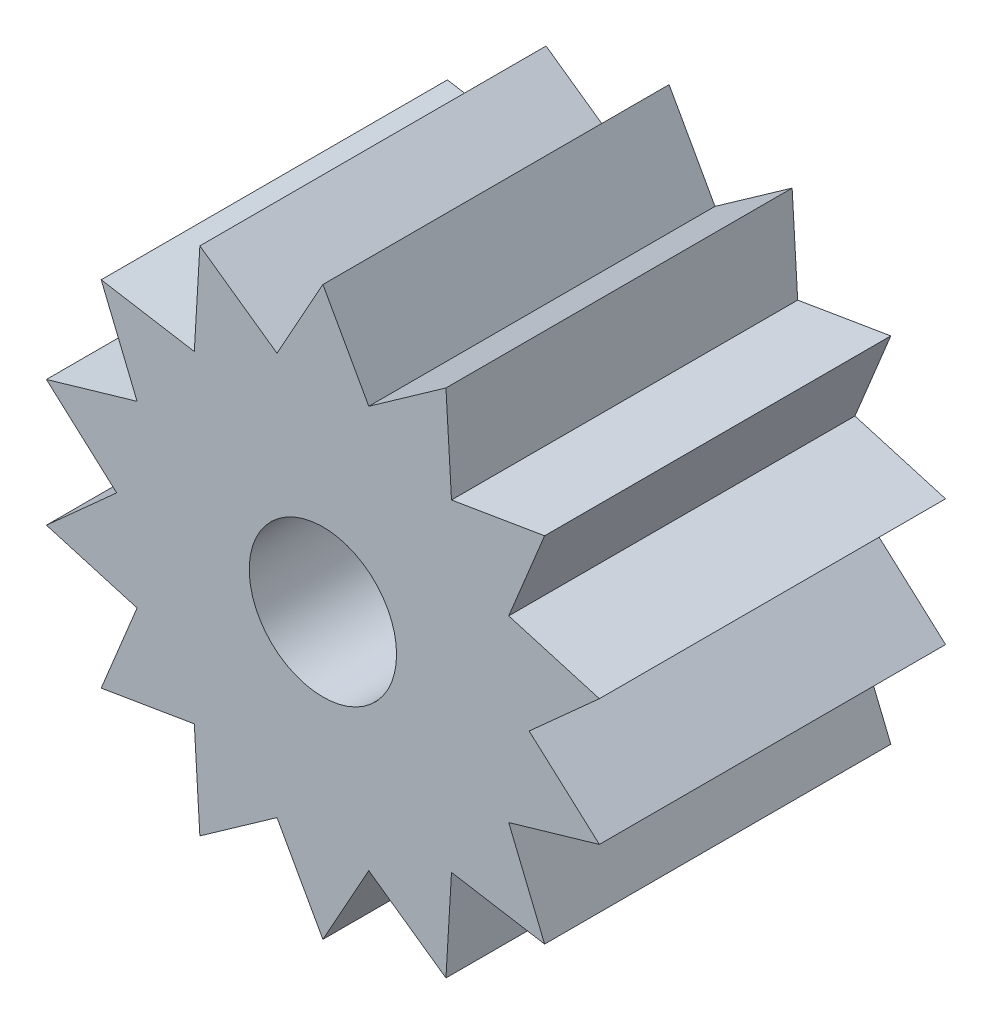
ISO-10303-21;
HEADER;
FILE_DESCRIPTION(('STEP AP214'),'2;1');
FILE_NAME('part.step','',(''),(''),'','','');
FILE_SCHEMA(('AUTOMOTIVE_DESIGN { 1 0 10303 214 1 1 1 1 }'));
ENDSEC;
DATA;
#1=APPLICATION_CONTEXT('core data for automotive mechanical design processes');
#2=APPLICATION_PROTOCOL_DEFINITION('international standard','automotive_design',2000,#1);
#3=PRODUCT_CONTEXT('',#1,'mechanical');
#4=PRODUCT('Part','Part','',(#3));
#5=PRODUCT_RELATED_PRODUCT_CATEGORY('part','',(#4));
#6=PRODUCT_DEFINITION_FORMATION('','',#4);
#7=PRODUCT_DEFINITION_CONTEXT('part definition',#1,'design');
#8=PRODUCT_DEFINITION('design','',#6,#7);
#9=PRODUCT_DEFINITION_SHAPE('','',#8);
#10=(LENGTH_UNIT() NAMED_UNIT(*) SI_UNIT(.MILLI.,.METRE.));
#11=(NAMED_UNIT(*) PLANE_ANGLE_UNIT() SI_UNIT($,.RADIAN.));
#12=(NAMED_UNIT(*) SI_UNIT($,.STERADIAN.) SOLID_ANGLE_UNIT());
#13=UNCERTAINTY_MEASURE_WITH_UNIT(LENGTH_MEASURE(1.E-05),#10,'distance_accuracy_value','');
#14=(GEOMETRIC_REPRESENTATION_CONTEXT(3) GLOBAL_UNCERTAINTY_ASSIGNED_CONTEXT((#13)) GLOBAL_UNIT_ASSIGNED_CONTEXT((#10,
#11,#12)) REPRESENTATION_CONTEXT('',''));
#15=CARTESIAN_POINT('',(0.,0.,0.));
#16=DIRECTION('',(0.,0.,1.));
#17=DIRECTION('',(1.,0.,0.));
#18=AXIS2_PLACEMENT_3D('',#15,#16,#17);
#19=CARTESIAN_POINT('',(0.,0.,4.7));
#20=DIRECTION('',(0.,0.,1.));
#21=DIRECTION('',(1.,0.,0.));
#22=AXIS2_PLACEMENT_3D('',#19,#20,#21);
#23=PLANE('',#22);
#24=DIRECTION('',(-0.0587596072921798,0.998272161562602,0.));
#25=VECTOR('',#24,1.);
#26=CARTESIAN_POINT('',(1.6704523956026,3.46873014142431,4.7));
#27=LINE('',#26,#25);
#28=CARTESIAN_POINT('',(1.74577144520446,2.18912815091048,4.7));
#29=VERTEX_POINT('',#28);
#30=CARTESIAN_POINT('',(1.6704523956026,3.46873014142431,4.7));
#31=VERTEX_POINT('',#30);
#32=EDGE_CURVE('E305',#29,#31,#27,.T.);
#33=ORIENTED_EDGE('',*,*,#32,.T.);
#34=DIRECTION('',(-0.817116619888953,-0.57647240133527,0.));
#35=VECTOR('',#34,1.);
#36=CARTESIAN_POINT('',(0.623058615077682,2.72979815410911,4.7));
#37=LINE('',#36,#35);
#38=CARTESIAN_POINT('',(0.623058615077682,2.72979815410911,4.7));
#39=VERTEX_POINT('',#38);
#40=EDGE_CURVE('E153',#31,#39,#37,.T.);
#41=ORIENTED_EDGE('',*,*,#40,.T.);
#42=DIRECTION('',(-0.486074634976176,0.873917301140547,0.));
#43=VECTOR('',#42,1.);
#44=CARTESIAN_POINT('',(0.,3.85,4.7));
#45=LINE('',#44,#43);
#46=CARTESIAN_POINT('',(0.,3.85,4.7));
#47=VERTEX_POINT('',#46);
#48=EDGE_CURVE('E380',#39,#47,#45,.T.);
#49=ORIENTED_EDGE('',*,*,#48,.T.);
#50=DIRECTION('',(-0.486074634976155,-0.873917301140558,0.));
#51=VECTOR('',#50,1.);
#52=CARTESIAN_POINT('',(-0.623058615077643,2.72979815410911,4.7));
#53=LINE('',#52,#51);
#54=CARTESIAN_POINT('',(-0.623058615077643,2.72979815410911,4.7));
#55=VERTEX_POINT('',#54);
#56=EDGE_CURVE('E399',#47,#55,#53,.T.);
#57=ORIENTED_EDGE('',*,*,#56,.T.);
#58=DIRECTION('',(-0.817116619888944,0.576472401335282,0.));
#59=VECTOR('',#58,1.);
#60=CARTESIAN_POINT('',(-1.67045239560255,3.46873014142434,4.7));
#61=LINE('',#60,#59);
#62=CARTESIAN_POINT('',(-1.67045239560255,3.46873014142434,4.7));
#63=VERTEX_POINT('',#62);
#64=EDGE_CURVE('E396',#55,#63,#61,.T.);
#65=ORIENTED_EDGE('',*,*,#64,.T.);
#66=DIRECTION('',(-0.0587596072921943,-0.998272161562601,0.));
#67=VECTOR('',#66,1.);
#68=CARTESIAN_POINT('',(-1.74577144520443,2.18912815091051,4.7));
#69=LINE('',#68,#67);
#70=CARTESIAN_POINT('',(-1.74577144520443,2.18912815091051,4.7));
#71=VERTEX_POINT('',#70);
#72=EDGE_CURVE('E398',#63,#71,#69,.T.);
#73=ORIENTED_EDGE('',*,*,#72,.T.);
#74=DIRECTION('',(-0.986318636955024,0.164850072475519,0.));
#75=VECTOR('',#74,1.);
#76=CARTESIAN_POINT('',(-3.01005120750189,2.40043573715616,4.7));
#77=LINE('',#76,#75);
#78=CARTESIAN_POINT('',(-3.01005120750189,2.40043573715616,4.7));
#79=VERTEX_POINT('',#78);
#80=EDGE_CURVE('E401',#71,#79,#77,.T.);
#81=ORIENTED_EDGE('',*,*,#80,.T.);
#82=DIRECTION('',(0.380193481255311,-0.924906977382573,0.));
#83=VECTOR('',#82,1.);
#84=CARTESIAN_POINT('',(-2.52271283012676,1.21487446952919,4.7));
#85=LINE('',#84,#83);
#86=CARTESIAN_POINT('',(-2.52271283012676,1.21487446952919,4.7));
#87=VERTEX_POINT('',#86);
#88=EDGE_CURVE('E407',#79,#87,#85,.T.);
#89=ORIENTED_EDGE('',*,*,#88,.T.);
#90=DIRECTION('',(-0.960168151567904,-0.279422834991478,0.));
#91=VECTOR('',#90,1.);
#92=CARTESIAN_POINT('',(-3.75347246190001,0.85670559573185,4.7));
#93=LINE('',#92,#91);
#94=CARTESIAN_POINT('',(-3.75347246190001,0.85670559573185,4.7));
#95=VERTEX_POINT('',#94);
#96=EDGE_CURVE('E409',#87,#95,#93,.T.);
#97=ORIENTED_EDGE('',*,*,#96,.T.);
#98=DIRECTION('',(0.743844588073147,-0.668352623092249,0.));
#99=VECTOR('',#98,1.);
#100=CARTESIAN_POINT('',(-2.8,0.,4.7));
#101=LINE('',#100,#99);
#102=CARTESIAN_POINT('',(-2.8,0.,4.7));
#103=VERTEX_POINT('',#102);
#104=EDGE_CURVE('E411',#95,#103,#101,.T.);
#105=ORIENTED_EDGE('',*,*,#104,.T.);
#106=DIRECTION('',(-0.743844588073161,-0.668352623092234,0.));
#107=VECTOR('',#106,1.);
#108=CARTESIAN_POINT('',(-3.75347246190003,-0.856705595731774,4.7));
#109=LINE('',#108,#107);
#110=CARTESIAN_POINT('',(-3.75347246190003,-0.856705595731774,4.7));
#111=VERTEX_POINT('',#110);
#112=EDGE_CURVE('E413',#103,#111,#109,.T.);
#113=ORIENTED_EDGE('',*,*,#112,.T.);
#114=DIRECTION('',(0.960168151567898,-0.279422834991498,0.));
#115=VECTOR('',#114,1.);
#116=CARTESIAN_POINT('',(-2.52271283012678,-1.21487446952914,4.7));
#117=LINE('',#116,#115);
#118=CARTESIAN_POINT('',(-2.52271283012678,-1.21487446952914,4.7));
#119=VERTEX_POINT('',#118);
#120=EDGE_CURVE('E415',#111,#119,#117,.T.);
#121=ORIENTED_EDGE('',*,*,#120,.T.);
#122=DIRECTION('',(-0.38019348125533,-0.924906977382565,0.));
#123=VECTOR('',#122,1.);
#124=CARTESIAN_POINT('',(-3.01005120750194,-2.4004357371561,4.7));
#125=LINE('',#124,#123);
#126=CARTESIAN_POINT('',(-3.01005120750194,-2.4004357371561,4.7));
#127=VERTEX_POINT('',#126);
#128=EDGE_CURVE('E417',#119,#127,#125,.T.);
#129=ORIENTED_EDGE('',*,*,#128,.T.);
#130=DIRECTION('',(0.986318636955027,0.1648500724755,0.));
#131=VECTOR('',#130,1.);
#132=CARTESIAN_POINT('',(-1.74577144520447,-2.18912815091047,4.7));
#133=LINE('',#132,#131);
#134=CARTESIAN_POINT('',(-1.74577144520447,-2.18912815091047,4.7));
#135=VERTEX_POINT('',#134);
#136=EDGE_CURVE('E419',#127,#135,#133,.T.);
#137=ORIENTED_EDGE('',*,*,#136,.T.);
#138=DIRECTION('',(0.0587596072921727,-0.998272161562602,0.));
#139=VECTOR('',#138,1.);
#140=CARTESIAN_POINT('',(-1.67045239560263,-3.4687301414243,4.7));
#141=LINE('',#140,#139);
#142=CARTESIAN_POINT('',(-1.67045239560263,-3.4687301414243,4.7));
#143=VERTEX_POINT('',#142);
#144=EDGE_CURVE('E421',#135,#143,#141,.T.);
#145=ORIENTED_EDGE('',*,*,#144,.T.);
#146=DIRECTION('',(0.817116619888957,0.576472401335264,0.));
#147=VECTOR('',#146,1.);
#148=CARTESIAN_POINT('',(-0.623058615077701,-2.7297981541091,4.7));
#149=LINE('',#148,#147);
#150=CARTESIAN_POINT('',(-0.623058615077701,-2.7297981541091,4.7));
#151=VERTEX_POINT('',#150);
#152=EDGE_CURVE('E423',#143,#151,#149,.T.);
#153=ORIENTED_EDGE('',*,*,#152,.T.);
#154=DIRECTION('',(0.48607463497617,-0.873917301140551,0.));
#155=VECTOR('',#154,1.);
#156=CARTESIAN_POINT('',(0.,-3.85,4.7));
#157=LINE('',#156,#155);
#158=CARTESIAN_POINT('',(0.,-3.85,4.7));
#159=VERTEX_POINT('',#158);
#160=EDGE_CURVE('E425',#151,#159,#157,.T.);
#161=ORIENTED_EDGE('',*,*,#160,.T.);
#162=DIRECTION('',(0.486074634976182,0.873917301140544,0.));
#163=VECTOR('',#162,1.);
#164=CARTESIAN_POINT('',(0.623058615077662,-2.72979815410911,4.7));
#165=LINE('',#164,#163);
#166=CARTESIAN_POINT('',(0.623058615077662,-2.72979815410911,4.7));
#167=VERTEX_POINT('',#166);
#168=EDGE_CURVE('E427',#159,#167,#165,.T.);
#169=ORIENTED_EDGE('',*,*,#168,.T.);
#170=DIRECTION('',(0.817116619888949,-0.576472401335275,0.));
#171=VECTOR('',#170,1.);
#172=CARTESIAN_POINT('',(1.67045239560258,-3.46873014142432,4.7));
#173=LINE('',#172,#171);
#174=CARTESIAN_POINT('',(1.67045239560258,-3.46873014142432,4.7));
#175=VERTEX_POINT('',#174);
#176=EDGE_CURVE('E429',#167,#175,#173,.T.);
#177=ORIENTED_EDGE('',*,*,#176,.T.);
#178=DIRECTION('',(0.0587596072921871,0.998272161562601,0.));
#179=VECTOR('',#178,1.);
#180=CARTESIAN_POINT('',(1.74577144520444,-2.18912815091049,4.7));
#181=LINE('',#180,#179);
#182=CARTESIAN_POINT('',(1.74577144520444,-2.18912815091049,4.7));
#183=VERTEX_POINT('',#182);
#184=EDGE_CURVE('E431',#175,#183,#181,.T.);
#185=ORIENTED_EDGE('',*,*,#184,.T.);
#186=DIRECTION('',(0.986318636955025,-0.164850072475514,0.));
#187=VECTOR('',#186,1.);
#188=CARTESIAN_POINT('',(3.0100512075019,-2.40043573715614,4.7));
#189=LINE('',#188,#187);
#190=CARTESIAN_POINT('',(3.0100512075019,-2.40043573715614,4.7));
#191=VERTEX_POINT('',#190);
#192=EDGE_CURVE('E433',#183,#191,#189,.T.);
#193=ORIENTED_EDGE('',*,*,#192,.T.);
#194=DIRECTION('',(-0.380193481255317,0.924906977382571,0.));
#195=VECTOR('',#194,1.);
#196=CARTESIAN_POINT('',(2.52271283012677,-1.21487446952917,4.7));
#197=LINE('',#196,#195);
#198=CARTESIAN_POINT('',(2.52271283012677,-1.21487446952917,4.7));
#199=VERTEX_POINT('',#198);
#200=EDGE_CURVE('E435',#191,#199,#197,.T.);
#201=ORIENTED_EDGE('',*,*,#200,.T.);
#202=DIRECTION('',(0.960168151567902,0.279422834991484,0.));
#203=VECTOR('',#202,1.);
#204=CARTESIAN_POINT('',(3.75347246190002,-0.856705595731826,4.7));
#205=LINE('',#204,#203);
#206=CARTESIAN_POINT('',(3.75347246190002,-0.856705595731826,4.7));
#207=VERTEX_POINT('',#206);
#208=EDGE_CURVE('E437',#199,#207,#205,.T.);
#209=ORIENTED_EDGE('',*,*,#208,.T.);
#210=DIRECTION('',(-0.743844588073151,0.668352623092244,0.));
#211=VECTOR('',#210,1.);
#212=CARTESIAN_POINT('',(2.8,0.,4.7));
#213=LINE('',#212,#211);
#214=CARTESIAN_POINT('',(2.8,0.,4.7));
#215=VERTEX_POINT('',#214);
#216=EDGE_CURVE('E439',#207,#215,#213,.T.);
#217=ORIENTED_EDGE('',*,*,#216,.T.);
#218=DIRECTION('',(0.743844588073156,0.668352623092239,0.));
#219=VECTOR('',#218,1.);
#220=CARTESIAN_POINT('',(3.75347246190002,0.856705595731799,4.7));
#221=LINE('',#220,#219);
#222=CARTESIAN_POINT('',(3.75347246190002,0.856705595731799,4.7));
#223=VERTEX_POINT('',#222);
#224=EDGE_CURVE('E232',#215,#223,#221,.T.);
#225=ORIENTED_EDGE('',*,*,#224,.T.);
#226=DIRECTION('',(-0.9601681515679,0.279422834991492,0.));
#227=VECTOR('',#226,1.);
#228=CARTESIAN_POINT('',(2.52271283012678,1.21487446952916,4.7));
#229=LINE('',#228,#227);
#230=CARTESIAN_POINT('',(2.52271283012678,1.21487446952916,4.7));
#231=VERTEX_POINT('',#230);
#232=EDGE_CURVE('E226',#223,#231,#229,.T.);
#233=ORIENTED_EDGE('',*,*,#232,.T.);
#234=DIRECTION('',(0.380193481255323,0.924906977382568,0.));
#235=VECTOR('',#234,1.);
#236=CARTESIAN_POINT('',(3.01005120750192,2.40043573715612,4.7));
#237=LINE('',#236,#235);
#238=CARTESIAN_POINT('',(3.01005120750192,2.40043573715612,4.7));
#239=VERTEX_POINT('',#238);
#240=EDGE_CURVE('E230',#231,#239,#237,.T.);
#241=ORIENTED_EDGE('',*,*,#240,.T.);
#242=DIRECTION('',(-0.986318636955026,-0.164850072475506,0.));
#243=VECTOR('',#242,1.);
#244=CARTESIAN_POINT('',(1.74577144520446,2.18912815091048,4.7));
#245=LINE('',#244,#243);
#246=EDGE_CURVE('E50',#239,#29,#245,.T.);
#247=ORIENTED_EDGE('',*,*,#246,.T.);
#248=EDGE_LOOP('',(#33,#41,#49,#57,#65,#73,#81,#89,#97,#105,#113,#121,#129,#137,#145,#153,#161,
#169,#177,#185,#193,#201,#209,#217,#225,#233,#241,#247));
#249=FACE_BOUND('',#248,.T.);
#250=CARTESIAN_POINT('',(0.,0.,4.7));
#251=DIRECTION('',(0.,0.,1.));
#252=DIRECTION('',(1.,0.,0.));
#253=AXIS2_PLACEMENT_3D('',#250,#251,#252);
#254=CIRCLE('',#253,1.);
#255=CARTESIAN_POINT('',(1.,0.,4.7));
#256=VERTEX_POINT('',#255);
#257=EDGE_CURVE('E254',#256,#256,#254,.T.);
#258=ORIENTED_EDGE('',*,*,#257,.F.);
#259=EDGE_LOOP('',(#258));
#260=FACE_BOUND('',#259,.T.);
#261=ADVANCED_FACE('F33',(#249,#260),#23,.T.);
#262=CARTESIAN_POINT('',(0.,0.,0.));
#263=DIRECTION('',(0.,0.,1.));
#264=DIRECTION('',(1.,0.,0.));
#265=AXIS2_PLACEMENT_3D('',#262,#263,#264);
#266=PLANE('',#265);
#267=DIRECTION('',(-0.0587596072921798,0.998272161562602,0.));
#268=VECTOR('',#267,1.);
#269=CARTESIAN_POINT('',(1.6704523956026,3.46873014142431,0.));
#270=LINE('',#269,#268);
#271=CARTESIAN_POINT('',(1.74577144520446,2.18912815091048,0.));
#272=VERTEX_POINT('',#271);
#273=CARTESIAN_POINT('',(1.6704523956026,3.46873014142431,0.));
#274=VERTEX_POINT('',#273);
#275=EDGE_CURVE('E250',#272,#274,#270,.T.);
#276=ORIENTED_EDGE('',*,*,#275,.F.);
#277=DIRECTION('',(-0.986318636955026,-0.164850072475506,0.));
#278=VECTOR('',#277,1.);
#279=CARTESIAN_POINT('',(1.74577144520446,2.18912815091048,0.));
#280=LINE('',#279,#278);
#281=CARTESIAN_POINT('',(3.01005120750192,2.40043573715612,0.));
#282=VERTEX_POINT('',#281);
#283=EDGE_CURVE('E145',#282,#272,#280,.T.);
#284=ORIENTED_EDGE('',*,*,#283,.F.);
#285=DIRECTION('',(0.380193481255323,0.924906977382568,0.));
#286=VECTOR('',#285,1.);
#287=CARTESIAN_POINT('',(3.01005120750192,2.40043573715612,0.));
#288=LINE('',#287,#286);
#289=CARTESIAN_POINT('',(2.52271283012678,1.21487446952916,0.));
#290=VERTEX_POINT('',#289);
#291=EDGE_CURVE('E139',#290,#282,#288,.T.);
#292=ORIENTED_EDGE('',*,*,#291,.F.);
#293=DIRECTION('',(-0.9601681515679,0.279422834991492,0.));
#294=VECTOR('',#293,1.);
#295=CARTESIAN_POINT('',(2.52271283012678,1.21487446952916,0.));
#296=LINE('',#295,#294);
#297=CARTESIAN_POINT('',(3.75347246190002,0.856705595731799,0.));
#298=VERTEX_POINT('',#297);
#299=EDGE_CURVE('E240',#298,#290,#296,.T.);
#300=ORIENTED_EDGE('',*,*,#299,.F.);
#301=DIRECTION('',(0.743844588073156,0.668352623092239,0.));
#302=VECTOR('',#301,1.);
#303=CARTESIAN_POINT('',(3.75347246190002,0.856705595731799,0.));
#304=LINE('',#303,#302);
#305=CARTESIAN_POINT('',(2.8,0.,0.));
#306=VERTEX_POINT('',#305);
#307=EDGE_CURVE('E300',#306,#298,#304,.T.);
#308=ORIENTED_EDGE('',*,*,#307,.F.);
#309=DIRECTION('',(-0.743844588073151,0.668352623092244,0.));
#310=VECTOR('',#309,1.);
#311=CARTESIAN_POINT('',(2.8,0.,0.));
#312=LINE('',#311,#310);
#313=CARTESIAN_POINT('',(3.75347246190002,-0.856705595731826,0.));
#314=VERTEX_POINT('',#313);
#315=EDGE_CURVE('E298',#314,#306,#312,.T.);
#316=ORIENTED_EDGE('',*,*,#315,.F.);
#317=DIRECTION('',(0.960168151567902,0.279422834991484,0.));
#318=VECTOR('',#317,1.);
#319=CARTESIAN_POINT('',(3.75347246190002,-0.856705595731826,0.));
#320=LINE('',#319,#318);
#321=CARTESIAN_POINT('',(2.52271283012677,-1.21487446952917,0.));
#322=VERTEX_POINT('',#321);
#323=EDGE_CURVE('E296',#322,#314,#320,.T.);
#324=ORIENTED_EDGE('',*,*,#323,.F.);
#325=DIRECTION('',(-0.380193481255317,0.924906977382571,0.));
#326=VECTOR('',#325,1.);
#327=CARTESIAN_POINT('',(2.52271283012677,-1.21487446952917,0.));
#328=LINE('',#327,#326);
#329=CARTESIAN_POINT('',(3.0100512075019,-2.40043573715614,0.));
#330=VERTEX_POINT('',#329);
#331=EDGE_CURVE('E294',#330,#322,#328,.T.);
#332=ORIENTED_EDGE('',*,*,#331,.F.);
#333=DIRECTION('',(0.986318636955025,-0.164850072475514,0.));
#334=VECTOR('',#333,1.);
#335=CARTESIAN_POINT('',(3.0100512075019,-2.40043573715614,0.));
#336=LINE('',#335,#334);
#337=CARTESIAN_POINT('',(1.74577144520444,-2.18912815091049,0.));
#338=VERTEX_POINT('',#337);
#339=EDGE_CURVE('E292',#338,#330,#336,.T.);
#340=ORIENTED_EDGE('',*,*,#339,.F.);
#341=DIRECTION('',(0.0587596072921871,0.998272161562601,0.));
#342=VECTOR('',#341,1.);
#343=CARTESIAN_POINT('',(1.74577144520444,-2.18912815091049,0.));
#344=LINE('',#343,#342);
#345=CARTESIAN_POINT('',(1.67045239560258,-3.46873014142432,0.));
#346=VERTEX_POINT('',#345);
#347=EDGE_CURVE('E290',#346,#338,#344,.T.);
#348=ORIENTED_EDGE('',*,*,#347,.F.);
#349=DIRECTION('',(0.817116619888949,-0.576472401335275,0.));
#350=VECTOR('',#349,1.);
#351=CARTESIAN_POINT('',(1.67045239560258,-3.46873014142432,0.));
#352=LINE('',#351,#350);
#353=CARTESIAN_POINT('',(0.623058615077662,-2.72979815410911,0.));
#354=VERTEX_POINT('',#353);
#355=EDGE_CURVE('E288',#354,#346,#352,.T.);
#356=ORIENTED_EDGE('',*,*,#355,.F.);
#357=DIRECTION('',(0.486074634976182,0.873917301140544,0.));
#358=VECTOR('',#357,1.);
#359=CARTESIAN_POINT('',(0.623058615077662,-2.72979815410911,0.));
#360=LINE('',#359,#358);
#361=CARTESIAN_POINT('',(0.,-3.85,0.));
#362=VERTEX_POINT('',#361);
#363=EDGE_CURVE('E286',#362,#354,#360,.T.);
#364=ORIENTED_EDGE('',*,*,#363,.F.);
#365=DIRECTION('',(0.48607463497617,-0.873917301140551,0.));
#366=VECTOR('',#365,1.);
#367=CARTESIAN_POINT('',(0.,-3.85,0.));
#368=LINE('',#367,#366);
#369=CARTESIAN_POINT('',(-0.623058615077701,-2.7297981541091,0.));
#370=VERTEX_POINT('',#369);
#371=EDGE_CURVE('E284',#370,#362,#368,.T.);
#372=ORIENTED_EDGE('',*,*,#371,.F.);
#373=DIRECTION('',(0.817116619888957,0.576472401335264,0.));
#374=VECTOR('',#373,1.);
#375=CARTESIAN_POINT('',(-0.623058615077701,-2.7297981541091,0.));
#376=LINE('',#375,#374);
#377=CARTESIAN_POINT('',(-1.67045239560263,-3.4687301414243,0.));
#378=VERTEX_POINT('',#377);
#379=EDGE_CURVE('E282',#378,#370,#376,.T.);
#380=ORIENTED_EDGE('',*,*,#379,.F.);
#381=DIRECTION('',(0.0587596072921727,-0.998272161562602,0.));
#382=VECTOR('',#381,1.);
#383=CARTESIAN_POINT('',(-1.67045239560263,-3.4687301414243,0.));
#384=LINE('',#383,#382);
#385=CARTESIAN_POINT('',(-1.74577144520447,-2.18912815091047,0.));
#386=VERTEX_POINT('',#385);
#387=EDGE_CURVE('E280',#386,#378,#384,.T.);
#388=ORIENTED_EDGE('',*,*,#387,.F.);
#389=DIRECTION('',(0.986318636955027,0.1648500724755,0.));
#390=VECTOR('',#389,1.);
#391=CARTESIAN_POINT('',(-1.74577144520447,-2.18912815091047,0.));
#392=LINE('',#391,#390);
#393=CARTESIAN_POINT('',(-3.01005120750194,-2.4004357371561,0.));
#394=VERTEX_POINT('',#393);
#395=EDGE_CURVE('E278',#394,#386,#392,.T.);
#396=ORIENTED_EDGE('',*,*,#395,.F.);
#397=DIRECTION('',(-0.38019348125533,-0.924906977382565,0.));
#398=VECTOR('',#397,1.);
#399=CARTESIAN_POINT('',(-3.01005120750194,-2.4004357371561,0.));
#400=LINE('',#399,#398);
#401=CARTESIAN_POINT('',(-2.52271283012678,-1.21487446952914,0.));
#402=VERTEX_POINT('',#401);
#403=EDGE_CURVE('E276',#402,#394,#400,.T.);
#404=ORIENTED_EDGE('',*,*,#403,.F.);
#405=DIRECTION('',(0.960168151567898,-0.279422834991498,0.));
#406=VECTOR('',#405,1.);
#407=CARTESIAN_POINT('',(-2.52271283012678,-1.21487446952914,0.));
#408=LINE('',#407,#406);
#409=CARTESIAN_POINT('',(-3.75347246190003,-0.856705595731774,0.));
#410=VERTEX_POINT('',#409);
#411=EDGE_CURVE('E274',#410,#402,#408,.T.);
#412=ORIENTED_EDGE('',*,*,#411,.F.);
#413=DIRECTION('',(-0.743844588073161,-0.668352623092234,0.));
#414=VECTOR('',#413,1.);
#415=CARTESIAN_POINT('',(-3.75347246190003,-0.856705595731774,0.));
#416=LINE('',#415,#414);
#417=CARTESIAN_POINT('',(-2.8,0.,0.));
#418=VERTEX_POINT('',#417);
#419=EDGE_CURVE('E272',#418,#410,#416,.T.);
#420=ORIENTED_EDGE('',*,*,#419,.F.);
#421=DIRECTION('',(0.743844588073147,-0.668352623092249,0.));
#422=VECTOR('',#421,1.);
#423=CARTESIAN_POINT('',(-2.8,0.,0.));
#424=LINE('',#423,#422);
#425=CARTESIAN_POINT('',(-3.75347246190001,0.85670559573185,0.));
#426=VERTEX_POINT('',#425);
#427=EDGE_CURVE('E270',#426,#418,#424,.T.);
#428=ORIENTED_EDGE('',*,*,#427,.F.);
#429=DIRECTION('',(-0.960168151567904,-0.279422834991478,0.));
#430=VECTOR('',#429,1.);
#431=CARTESIAN_POINT('',(-3.75347246190001,0.85670559573185,0.));
#432=LINE('',#431,#430);
#433=CARTESIAN_POINT('',(-2.52271283012676,1.21487446952919,0.));
#434=VERTEX_POINT('',#433);
#435=EDGE_CURVE('E268',#434,#426,#432,.T.);
#436=ORIENTED_EDGE('',*,*,#435,.F.);
#437=DIRECTION('',(0.380193481255311,-0.924906977382573,0.));
#438=VECTOR('',#437,1.);
#439=CARTESIAN_POINT('',(-2.52271283012676,1.21487446952919,0.));
#440=LINE('',#439,#438);
#441=CARTESIAN_POINT('',(-3.01005120750189,2.40043573715616,0.));
#442=VERTEX_POINT('',#441);
#443=EDGE_CURVE('E266',#442,#434,#440,.T.);
#444=ORIENTED_EDGE('',*,*,#443,.F.);
#445=DIRECTION('',(-0.986318636955024,0.164850072475519,0.));
#446=VECTOR('',#445,1.);
#447=CARTESIAN_POINT('',(-3.01005120750189,2.40043573715616,0.));
#448=LINE('',#447,#446);
#449=CARTESIAN_POINT('',(-1.74577144520443,2.18912815091051,0.));
#450=VERTEX_POINT('',#449);
#451=EDGE_CURVE('E264',#450,#442,#448,.T.);
#452=ORIENTED_EDGE('',*,*,#451,.F.);
#453=DIRECTION('',(-0.0587596072921943,-0.998272161562601,0.));
#454=VECTOR('',#453,1.);
#455=CARTESIAN_POINT('',(-1.74577144520443,2.18912815091051,0.));
#456=LINE('',#455,#454);
#457=CARTESIAN_POINT('',(-1.67045239560255,3.46873014142434,0.));
#458=VERTEX_POINT('',#457);
#459=EDGE_CURVE('E262',#458,#450,#456,.T.);
#460=ORIENTED_EDGE('',*,*,#459,.F.);
#461=DIRECTION('',(-0.817116619888944,0.576472401335282,0.));
#462=VECTOR('',#461,1.);
#463=CARTESIAN_POINT('',(-1.67045239560255,3.46873014142434,0.));
#464=LINE('',#463,#462);
#465=CARTESIAN_POINT('',(-0.623058615077643,2.72979815410911,0.));
#466=VERTEX_POINT('',#465);
#467=EDGE_CURVE('E260',#466,#458,#464,.T.);
#468=ORIENTED_EDGE('',*,*,#467,.F.);
#469=DIRECTION('',(-0.486074634976155,-0.873917301140558,0.));
#470=VECTOR('',#469,1.);
#471=CARTESIAN_POINT('',(-0.623058615077643,2.72979815410911,0.));
#472=LINE('',#471,#470);
#473=CARTESIAN_POINT('',(0.,3.85,0.));
#474=VERTEX_POINT('',#473);
#475=EDGE_CURVE('E258',#474,#466,#472,.T.);
#476=ORIENTED_EDGE('',*,*,#475,.F.);
#477=DIRECTION('',(-0.486074634976176,0.873917301140547,0.));
#478=VECTOR('',#477,1.);
#479=CARTESIAN_POINT('',(0.,3.85,0.));
#480=LINE('',#479,#478);
#481=CARTESIAN_POINT('',(0.623058615077682,2.72979815410911,0.));
#482=VERTEX_POINT('',#481);
#483=EDGE_CURVE('E256',#482,#474,#480,.T.);
#484=ORIENTED_EDGE('',*,*,#483,.F.);
#485=DIRECTION('',(-0.817116619888953,-0.57647240133527,0.));
#486=VECTOR('',#485,1.);
#487=CARTESIAN_POINT('',(0.623058615077682,2.72979815410911,0.));
#488=LINE('',#487,#486);
#489=EDGE_CURVE('E253',#274,#482,#488,.T.);
#490=ORIENTED_EDGE('',*,*,#489,.F.);
#491=EDGE_LOOP('',(#276,#284,#292,#300,#308,#316,#324,#332,#340,#348,#356,#364,#372,#380,#388,
#396,#404,#412,#420,#428,#436,#444,#452,#460,#468,#476,#484,#490));
#492=FACE_BOUND('',#491,.T.);
#493=CARTESIAN_POINT('',(0.,0.,0.));
#494=DIRECTION('',(0.,0.,1.));
#495=DIRECTION('',(1.,0.,0.));
#496=AXIS2_PLACEMENT_3D('',#493,#494,#495);
#497=CIRCLE('',#496,1.);
#498=CARTESIAN_POINT('',(1.,0.,0.));
#499=VERTEX_POINT('',#498);
#500=EDGE_CURVE('E794',#499,#499,#497,.T.);
#501=ORIENTED_EDGE('',*,*,#500,.T.);
#502=EDGE_LOOP('',(#501));
#503=FACE_BOUND('',#502,.T.);
#504=ADVANCED_FACE('F384',(#492,#503),#266,.F.);
#505=CARTESIAN_POINT('',(1.6704523956026,3.46873014142431,4.7));
#506=DIRECTION('',(-0.998272161562602,-0.0587596072921798,0.));
#507=DIRECTION('',(0.0587596072921798,-0.998272161562602,0.));
#508=AXIS2_PLACEMENT_3D('',#505,#506,#507);
#509=PLANE('',#508);
#510=ORIENTED_EDGE('',*,*,#275,.T.);
#511=DIRECTION('',(0.,0.,-1.));
#512=VECTOR('',#511,1.);
#513=CARTESIAN_POINT('',(1.6704523956026,3.46873014142431,4.7));
#514=LINE('',#513,#512);
#515=EDGE_CURVE('E11',#31,#274,#514,.T.);
#516=ORIENTED_EDGE('',*,*,#515,.F.);
#517=ORIENTED_EDGE('',*,*,#32,.F.);
#518=DIRECTION('',(0.,0.,-1.));
#519=VECTOR('',#518,1.);
#520=CARTESIAN_POINT('',(1.74577144520446,2.18912815091048,4.7));
#521=LINE('',#520,#519);
#522=EDGE_CURVE('E246',#29,#272,#521,.T.);
#523=ORIENTED_EDGE('',*,*,#522,.T.);
#524=EDGE_LOOP('',(#510,#516,#517,#523));
#525=FACE_BOUND('',#524,.T.);
#526=ADVANCED_FACE('F35',(#525),#509,.F.);
#527=CARTESIAN_POINT('',(0.623058615077682,2.72979815410911,4.7));
#528=DIRECTION('',(0.57647240133527,-0.817116619888953,0.));
#529=DIRECTION('',(0.817116619888953,0.57647240133527,0.));
#530=AXIS2_PLACEMENT_3D('',#527,#528,#529);
#531=PLANE('',#530);
#532=ORIENTED_EDGE('',*,*,#489,.T.);
#533=DIRECTION('',(0.,0.,-1.));
#534=VECTOR('',#533,1.);
#535=CARTESIAN_POINT('',(0.623058615077682,2.72979815410911,4.7));
#536=LINE('',#535,#534);
#537=EDGE_CURVE('E42',#39,#482,#536,.T.);
#538=ORIENTED_EDGE('',*,*,#537,.F.);
#539=ORIENTED_EDGE('',*,*,#40,.F.);
#540=ORIENTED_EDGE('',*,*,#515,.T.);
#541=EDGE_LOOP('',(#532,#538,#539,#540));
#542=FACE_BOUND('',#541,.T.);
#543=ADVANCED_FACE('F473',(#542),#531,.F.);
#544=CARTESIAN_POINT('',(0.,3.85,4.7));
#545=DIRECTION('',(-0.873917301140547,-0.486074634976176,0.));
#546=DIRECTION('',(0.486074634976176,-0.873917301140547,0.));
#547=AXIS2_PLACEMENT_3D('',#544,#545,#546);
#548=PLANE('',#547);
#549=ORIENTED_EDGE('',*,*,#483,.T.);
#550=DIRECTION('',(0.,0.,-1.));
#551=VECTOR('',#550,1.);
#552=CARTESIAN_POINT('',(0.,3.85,4.7));
#553=LINE('',#552,#551);
#554=EDGE_CURVE('E372',#47,#474,#553,.T.);
#555=ORIENTED_EDGE('',*,*,#554,.F.);
#556=ORIENTED_EDGE('',*,*,#48,.F.);
#557=ORIENTED_EDGE('',*,*,#537,.T.);
#558=EDGE_LOOP('',(#549,#555,#556,#557));
#559=FACE_BOUND('',#558,.T.);
#560=ADVANCED_FACE('F378',(#559),#548,.F.);
#561=CARTESIAN_POINT('',(-0.623058615077643,2.72979815410911,4.7));
#562=DIRECTION('',(0.873917301140558,-0.486074634976155,0.));
#563=DIRECTION('',(0.486074634976155,0.873917301140559,0.));
#564=AXIS2_PLACEMENT_3D('',#561,#562,#563);
#565=PLANE('',#564);
#566=ORIENTED_EDGE('',*,*,#475,.T.);
#567=DIRECTION('',(0.,0.,-1.));
#568=VECTOR('',#567,1.);
#569=CARTESIAN_POINT('',(-0.623058615077643,2.72979815410911,4.7));
#570=LINE('',#569,#568);
#571=EDGE_CURVE('E369',#55,#466,#570,.T.);
#572=ORIENTED_EDGE('',*,*,#571,.F.);
#573=ORIENTED_EDGE('',*,*,#56,.F.);
#574=ORIENTED_EDGE('',*,*,#554,.T.);
#575=EDGE_LOOP('',(#566,#572,#573,#574));
#576=FACE_BOUND('',#575,.T.);
#577=ADVANCED_FACE('F390',(#576),#565,.F.);
#578=CARTESIAN_POINT('',(-1.67045239560255,3.46873014142434,4.7));
#579=DIRECTION('',(-0.576472401335282,-0.817116619888944,0.));
#580=DIRECTION('',(0.817116619888944,-0.576472401335282,0.));
#581=AXIS2_PLACEMENT_3D('',#578,#579,#580);
#582=PLANE('',#581);
#583=ORIENTED_EDGE('',*,*,#467,.T.);
#584=DIRECTION('',(0.,0.,-1.));
#585=VECTOR('',#584,1.);
#586=CARTESIAN_POINT('',(-1.67045239560255,3.46873014142434,4.7));
#587=LINE('',#586,#585);
#588=EDGE_CURVE('E366',#63,#458,#587,.T.);
#589=ORIENTED_EDGE('',*,*,#588,.F.);
#590=ORIENTED_EDGE('',*,*,#64,.F.);
#591=ORIENTED_EDGE('',*,*,#571,.T.);
#592=EDGE_LOOP('',(#583,#589,#590,#591));
#593=FACE_BOUND('',#592,.T.);
#594=ADVANCED_FACE('F394',(#593),#582,.F.);
#595=CARTESIAN_POINT('',(-1.74577144520443,2.18912815091051,4.7));
#596=DIRECTION('',(0.998272161562601,-0.0587596072921943,0.));
#597=DIRECTION('',(0.0587596072921943,0.998272161562601,0.));
#598=AXIS2_PLACEMENT_3D('',#595,#596,#597);
#599=PLANE('',#598);
#600=ORIENTED_EDGE('',*,*,#459,.T.);
#601=DIRECTION('',(0.,0.,-1.));
#602=VECTOR('',#601,1.);
#603=CARTESIAN_POINT('',(-1.74577144520443,2.18912815091051,4.7));
#604=LINE('',#603,#602);
#605=EDGE_CURVE('E363',#71,#450,#604,.T.);
#606=ORIENTED_EDGE('',*,*,#605,.F.);
#607=ORIENTED_EDGE('',*,*,#72,.F.);
#608=ORIENTED_EDGE('',*,*,#588,.T.);
#609=EDGE_LOOP('',(#600,#606,#607,#608));
#610=FACE_BOUND('',#609,.T.);
#611=ADVANCED_FACE('F486',(#610),#599,.F.);
#612=CARTESIAN_POINT('',(-3.01005120750189,2.40043573715616,4.7));
#613=DIRECTION('',(-0.164850072475519,-0.986318636955024,0.));
#614=DIRECTION('',(0.986318636955024,-0.164850072475519,0.));
#615=AXIS2_PLACEMENT_3D('',#612,#613,#614);
#616=PLANE('',#615);
#617=ORIENTED_EDGE('',*,*,#451,.T.);
#618=DIRECTION('',(0.,0.,-1.));
#619=VECTOR('',#618,1.);
#620=CARTESIAN_POINT('',(-3.01005120750189,2.40043573715616,4.7));
#621=LINE('',#620,#619);
#622=EDGE_CURVE('E360',#79,#442,#621,.T.);
#623=ORIENTED_EDGE('',*,*,#622,.F.);
#624=ORIENTED_EDGE('',*,*,#80,.F.);
#625=ORIENTED_EDGE('',*,*,#605,.T.);
#626=EDGE_LOOP('',(#617,#623,#624,#625));
#627=FACE_BOUND('',#626,.T.);
#628=ADVANCED_FACE('F489',(#627),#616,.F.);
#629=CARTESIAN_POINT('',(-2.52271283012676,1.21487446952919,4.7));
#630=DIRECTION('',(0.924906977382573,0.38019348125531,0.));
#631=DIRECTION('',(-0.38019348125531,0.924906977382573,0.));
#632=AXIS2_PLACEMENT_3D('',#629,#630,#631);
#633=PLANE('',#632);
#634=ORIENTED_EDGE('',*,*,#443,.T.);
#635=DIRECTION('',(0.,0.,-1.));
#636=VECTOR('',#635,1.);
#637=CARTESIAN_POINT('',(-2.52271283012676,1.21487446952919,4.7));
#638=LINE('',#637,#636);
#639=EDGE_CURVE('E357',#87,#434,#638,.T.);
#640=ORIENTED_EDGE('',*,*,#639,.F.);
#641=ORIENTED_EDGE('',*,*,#88,.F.);
#642=ORIENTED_EDGE('',*,*,#622,.T.);
#643=EDGE_LOOP('',(#634,#640,#641,#642));
#644=FACE_BOUND('',#643,.T.);
#645=ADVANCED_FACE('F493',(#644),#633,.F.);
#646=CARTESIAN_POINT('',(-3.75347246190001,0.85670559573185,4.7));
#647=DIRECTION('',(0.279422834991478,-0.960168151567904,0.));
#648=DIRECTION('',(0.960168151567904,0.279422834991478,0.));
#649=AXIS2_PLACEMENT_3D('',#646,#647,#648);
#650=PLANE('',#649);
#651=ORIENTED_EDGE('',*,*,#435,.T.);
#652=DIRECTION('',(0.,0.,-1.));
#653=VECTOR('',#652,1.);
#654=CARTESIAN_POINT('',(-3.75347246190001,0.85670559573185,4.7));
#655=LINE('',#654,#653);
#656=EDGE_CURVE('E354',#95,#426,#655,.T.);
#657=ORIENTED_EDGE('',*,*,#656,.F.);
#658=ORIENTED_EDGE('',*,*,#96,.F.);
#659=ORIENTED_EDGE('',*,*,#639,.T.);
#660=EDGE_LOOP('',(#651,#657,#658,#659));
#661=FACE_BOUND('',#660,.T.);
#662=ADVANCED_FACE('F497',(#661),#650,.F.);
#663=CARTESIAN_POINT('',(-2.8,0.,4.7));
#664=DIRECTION('',(0.668352623092249,0.743844588073147,0.));
#665=DIRECTION('',(-0.743844588073147,0.668352623092249,0.));
#666=AXIS2_PLACEMENT_3D('',#663,#664,#665);
#667=PLANE('',#666);
#668=ORIENTED_EDGE('',*,*,#427,.T.);
#669=DIRECTION('',(0.,0.,-1.));
#670=VECTOR('',#669,1.);
#671=CARTESIAN_POINT('',(-2.8,0.,4.7));
#672=LINE('',#671,#670);
#673=EDGE_CURVE('E351',#103,#418,#672,.T.);
#674=ORIENTED_EDGE('',*,*,#673,.F.);
#675=ORIENTED_EDGE('',*,*,#104,.F.);
#676=ORIENTED_EDGE('',*,*,#656,.T.);
#677=EDGE_LOOP('',(#668,#674,#675,#676));
#678=FACE_BOUND('',#677,.T.);
#679=ADVANCED_FACE('F501',(#678),#667,.F.);
#680=CARTESIAN_POINT('',(-3.75347246190003,-0.856705595731774,4.7));
#681=DIRECTION('',(0.668352623092234,-0.743844588073161,0.));
#682=DIRECTION('',(0.743844588073161,0.668352623092234,0.));
#683=AXIS2_PLACEMENT_3D('',#680,#681,#682);
#684=PLANE('',#683);
#685=ORIENTED_EDGE('',*,*,#419,.T.);
#686=DIRECTION('',(0.,0.,-1.));
#687=VECTOR('',#686,1.);
#688=CARTESIAN_POINT('',(-3.75347246190003,-0.856705595731774,4.7));
#689=LINE('',#688,#687);
#690=EDGE_CURVE('E348',#111,#410,#689,.T.);
#691=ORIENTED_EDGE('',*,*,#690,.F.);
#692=ORIENTED_EDGE('',*,*,#112,.F.);
#693=ORIENTED_EDGE('',*,*,#673,.T.);
#694=EDGE_LOOP('',(#685,#691,#692,#693));
#695=FACE_BOUND('',#694,.T.);
#696=ADVANCED_FACE('F505',(#695),#684,.F.);
#697=CARTESIAN_POINT('',(-2.52271283012678,-1.21487446952914,4.7));
#698=DIRECTION('',(0.279422834991498,0.960168151567898,0.));
#699=DIRECTION('',(-0.960168151567898,0.279422834991498,0.));
#700=AXIS2_PLACEMENT_3D('',#697,#698,#699);
#701=PLANE('',#700);
#702=ORIENTED_EDGE('',*,*,#411,.T.);
#703=DIRECTION('',(0.,0.,-1.));
#704=VECTOR('',#703,1.);
#705=CARTESIAN_POINT('',(-2.52271283012678,-1.21487446952914,4.7));
#706=LINE('',#705,#704);
#707=EDGE_CURVE('E345',#119,#402,#706,.T.);
#708=ORIENTED_EDGE('',*,*,#707,.F.);
#709=ORIENTED_EDGE('',*,*,#120,.F.);
#710=ORIENTED_EDGE('',*,*,#690,.T.);
#711=EDGE_LOOP('',(#702,#708,#709,#710));
#712=FACE_BOUND('',#711,.T.);
#713=ADVANCED_FACE('F509',(#712),#701,.F.);
#714=CARTESIAN_POINT('',(-3.01005120750194,-2.4004357371561,4.7));
#715=DIRECTION('',(0.924906977382565,-0.38019348125533,0.));
#716=DIRECTION('',(0.38019348125533,0.924906977382565,0.));
#717=AXIS2_PLACEMENT_3D('',#714,#715,#716);
#718=PLANE('',#717);
#719=ORIENTED_EDGE('',*,*,#403,.T.);
#720=DIRECTION('',(0.,0.,-1.));
#721=VECTOR('',#720,1.);
#722=CARTESIAN_POINT('',(-3.01005120750194,-2.4004357371561,4.7));
#723=LINE('',#722,#721);
#724=EDGE_CURVE('E342',#127,#394,#723,.T.);
#725=ORIENTED_EDGE('',*,*,#724,.F.);
#726=ORIENTED_EDGE('',*,*,#128,.F.);
#727=ORIENTED_EDGE('',*,*,#707,.T.);
#728=EDGE_LOOP('',(#719,#725,#726,#727));
#729=FACE_BOUND('',#728,.T.);
#730=ADVANCED_FACE('F513',(#729),#718,.F.);
#731=CARTESIAN_POINT('',(-1.74577144520447,-2.18912815091047,4.7));
#732=DIRECTION('',(-0.1648500724755,0.986318636955027,0.));
#733=DIRECTION('',(-0.986318636955027,-0.1648500724755,0.));
#734=AXIS2_PLACEMENT_3D('',#731,#732,#733);
#735=PLANE('',#734);
#736=ORIENTED_EDGE('',*,*,#395,.T.);
#737=DIRECTION('',(0.,0.,-1.));
#738=VECTOR('',#737,1.);
#739=CARTESIAN_POINT('',(-1.74577144520447,-2.18912815091047,4.7));
#740=LINE('',#739,#738);
#741=EDGE_CURVE('E339',#135,#386,#740,.T.);
#742=ORIENTED_EDGE('',*,*,#741,.F.);
#743=ORIENTED_EDGE('',*,*,#136,.F.);
#744=ORIENTED_EDGE('',*,*,#724,.T.);
#745=EDGE_LOOP('',(#736,#742,#743,#744));
#746=FACE_BOUND('',#745,.T.);
#747=ADVANCED_FACE('F517',(#746),#735,.F.);
#748=CARTESIAN_POINT('',(-1.67045239560263,-3.4687301414243,4.7));
#749=DIRECTION('',(0.998272161562602,0.0587596072921727,0.));
#750=DIRECTION('',(-0.0587596072921727,0.998272161562602,0.));
#751=AXIS2_PLACEMENT_3D('',#748,#749,#750);
#752=PLANE('',#751);
#753=ORIENTED_EDGE('',*,*,#387,.T.);
#754=DIRECTION('',(0.,0.,-1.));
#755=VECTOR('',#754,1.);
#756=CARTESIAN_POINT('',(-1.67045239560263,-3.4687301414243,4.7));
#757=LINE('',#756,#755);
#758=EDGE_CURVE('E336',#143,#378,#757,.T.);
#759=ORIENTED_EDGE('',*,*,#758,.F.);
#760=ORIENTED_EDGE('',*,*,#144,.F.);
#761=ORIENTED_EDGE('',*,*,#741,.T.);
#762=EDGE_LOOP('',(#753,#759,#760,#761));
#763=FACE_BOUND('',#762,.T.);
#764=ADVANCED_FACE('F521',(#763),#752,.F.);
#765=CARTESIAN_POINT('',(-0.623058615077701,-2.7297981541091,4.7));
#766=DIRECTION('',(-0.576472401335264,0.817116619888957,0.));
#767=DIRECTION('',(-0.817116619888957,-0.576472401335264,0.));
#768=AXIS2_PLACEMENT_3D('',#765,#766,#767);
#769=PLANE('',#768);
#770=ORIENTED_EDGE('',*,*,#379,.T.);
#771=DIRECTION('',(0.,0.,-1.));
#772=VECTOR('',#771,1.);
#773=CARTESIAN_POINT('',(-0.623058615077701,-2.7297981541091,4.7));
#774=LINE('',#773,#772);
#775=EDGE_CURVE('E333',#151,#370,#774,.T.);
#776=ORIENTED_EDGE('',*,*,#775,.F.);
#777=ORIENTED_EDGE('',*,*,#152,.F.);
#778=ORIENTED_EDGE('',*,*,#758,.T.);
#779=EDGE_LOOP('',(#770,#776,#777,#778));
#780=FACE_BOUND('',#779,.T.);
#781=ADVANCED_FACE('F525',(#780),#769,.F.);
#782=CARTESIAN_POINT('',(0.,-3.85,4.7));
#783=DIRECTION('',(0.87391730114055,0.48607463497617,0.));
#784=DIRECTION('',(-0.48607463497617,0.873917301140551,0.));
#785=AXIS2_PLACEMENT_3D('',#782,#783,#784);
#786=PLANE('',#785);
#787=ORIENTED_EDGE('',*,*,#371,.T.);
#788=DIRECTION('',(0.,0.,-1.));
#789=VECTOR('',#788,1.);
#790=CARTESIAN_POINT('',(0.,-3.85,4.7));
#791=LINE('',#790,#789);
#792=EDGE_CURVE('E330',#159,#362,#791,.T.);
#793=ORIENTED_EDGE('',*,*,#792,.F.);
#794=ORIENTED_EDGE('',*,*,#160,.F.);
#795=ORIENTED_EDGE('',*,*,#775,.T.);
#796=EDGE_LOOP('',(#787,#793,#794,#795));
#797=FACE_BOUND('',#796,.T.);
#798=ADVANCED_FACE('F529',(#797),#786,.F.);
#799=CARTESIAN_POINT('',(0.623058615077662,-2.72979815410911,4.7));
#800=DIRECTION('',(-0.873917301140543,0.486074634976182,0.));
#801=DIRECTION('',(-0.486074634976182,-0.873917301140544,0.));
#802=AXIS2_PLACEMENT_3D('',#799,#800,#801);
#803=PLANE('',#802);
#804=ORIENTED_EDGE('',*,*,#363,.T.);
#805=DIRECTION('',(0.,0.,-1.));
#806=VECTOR('',#805,1.);
#807=CARTESIAN_POINT('',(0.623058615077662,-2.72979815410911,4.7));
#808=LINE('',#807,#806);
#809=EDGE_CURVE('E327',#167,#354,#808,.T.);
#810=ORIENTED_EDGE('',*,*,#809,.F.);
#811=ORIENTED_EDGE('',*,*,#168,.F.);
#812=ORIENTED_EDGE('',*,*,#792,.T.);
#813=EDGE_LOOP('',(#804,#810,#811,#812));
#814=FACE_BOUND('',#813,.T.);
#815=ADVANCED_FACE('F533',(#814),#803,.F.);
#816=CARTESIAN_POINT('',(1.67045239560258,-3.46873014142432,4.7));
#817=DIRECTION('',(0.576472401335275,0.817116619888949,0.));
#818=DIRECTION('',(-0.817116619888949,0.576472401335275,0.));
#819=AXIS2_PLACEMENT_3D('',#816,#817,#818);
#820=PLANE('',#819);
#821=ORIENTED_EDGE('',*,*,#355,.T.);
#822=DIRECTION('',(0.,0.,-1.));
#823=VECTOR('',#822,1.);
#824=CARTESIAN_POINT('',(1.67045239560258,-3.46873014142432,4.7));
#825=LINE('',#824,#823);
#826=EDGE_CURVE('E324',#175,#346,#825,.T.);
#827=ORIENTED_EDGE('',*,*,#826,.F.);
#828=ORIENTED_EDGE('',*,*,#176,.F.);
#829=ORIENTED_EDGE('',*,*,#809,.T.);
#830=EDGE_LOOP('',(#821,#827,#828,#829));
#831=FACE_BOUND('',#830,.T.);
#832=ADVANCED_FACE('F537',(#831),#820,.F.);
#833=CARTESIAN_POINT('',(1.74577144520444,-2.18912815091049,4.7));
#834=DIRECTION('',(-0.998272161562601,0.0587596072921871,0.));
#835=DIRECTION('',(-0.0587596072921871,-0.998272161562601,0.));
#836=AXIS2_PLACEMENT_3D('',#833,#834,#835);
#837=PLANE('',#836);
#838=ORIENTED_EDGE('',*,*,#347,.T.);
#839=DIRECTION('',(0.,0.,-1.));
#840=VECTOR('',#839,1.);
#841=CARTESIAN_POINT('',(1.74577144520444,-2.18912815091049,4.7));
#842=LINE('',#841,#840);
#843=EDGE_CURVE('E321',#183,#338,#842,.T.);
#844=ORIENTED_EDGE('',*,*,#843,.F.);
#845=ORIENTED_EDGE('',*,*,#184,.F.);
#846=ORIENTED_EDGE('',*,*,#826,.T.);
#847=EDGE_LOOP('',(#838,#844,#845,#846));
#848=FACE_BOUND('',#847,.T.);
#849=ADVANCED_FACE('F541',(#848),#837,.F.);
#850=CARTESIAN_POINT('',(3.0100512075019,-2.40043573715614,4.7));
#851=DIRECTION('',(0.164850072475514,0.986318636955025,0.));
#852=DIRECTION('',(-0.986318636955025,0.164850072475514,0.));
#853=AXIS2_PLACEMENT_3D('',#850,#851,#852);
#854=PLANE('',#853);
#855=ORIENTED_EDGE('',*,*,#339,.T.);
#856=DIRECTION('',(0.,0.,-1.));
#857=VECTOR('',#856,1.);
#858=CARTESIAN_POINT('',(3.0100512075019,-2.40043573715614,4.7));
#859=LINE('',#858,#857);
#860=EDGE_CURVE('E318',#191,#330,#859,.T.);
#861=ORIENTED_EDGE('',*,*,#860,.F.);
#862=ORIENTED_EDGE('',*,*,#192,.F.);
#863=ORIENTED_EDGE('',*,*,#843,.T.);
#864=EDGE_LOOP('',(#855,#861,#862,#863));
#865=FACE_BOUND('',#864,.T.);
#866=ADVANCED_FACE('F545',(#865),#854,.F.);
#867=CARTESIAN_POINT('',(2.52271283012677,-1.21487446952917,4.7));
#868=DIRECTION('',(-0.924906977382571,-0.380193481255317,0.));
#869=DIRECTION('',(0.380193481255317,-0.924906977382571,0.));
#870=AXIS2_PLACEMENT_3D('',#867,#868,#869);
#871=PLANE('',#870);
#872=ORIENTED_EDGE('',*,*,#331,.T.);
#873=DIRECTION('',(0.,0.,-1.));
#874=VECTOR('',#873,1.);
#875=CARTESIAN_POINT('',(2.52271283012677,-1.21487446952917,4.7));
#876=LINE('',#875,#874);
#877=EDGE_CURVE('E315',#199,#322,#876,.T.);
#878=ORIENTED_EDGE('',*,*,#877,.F.);
#879=ORIENTED_EDGE('',*,*,#200,.F.);
#880=ORIENTED_EDGE('',*,*,#860,.T.);
#881=EDGE_LOOP('',(#872,#878,#879,#880));
#882=FACE_BOUND('',#881,.T.);
#883=ADVANCED_FACE('F549',(#882),#871,.F.);
#884=CARTESIAN_POINT('',(3.75347246190002,-0.856705595731826,4.7));
#885=DIRECTION('',(-0.279422834991484,0.960168151567902,0.));
#886=DIRECTION('',(-0.960168151567902,-0.279422834991484,0.));
#887=AXIS2_PLACEMENT_3D('',#884,#885,#886);
#888=PLANE('',#887);
#889=ORIENTED_EDGE('',*,*,#323,.T.);
#890=DIRECTION('',(0.,0.,-1.));
#891=VECTOR('',#890,1.);
#892=CARTESIAN_POINT('',(3.75347246190002,-0.856705595731826,4.7));
#893=LINE('',#892,#891);
#894=EDGE_CURVE('E312',#207,#314,#893,.T.);
#895=ORIENTED_EDGE('',*,*,#894,.F.);
#896=ORIENTED_EDGE('',*,*,#208,.F.);
#897=ORIENTED_EDGE('',*,*,#877,.T.);
#898=EDGE_LOOP('',(#889,#895,#896,#897));
#899=FACE_BOUND('',#898,.T.);
#900=ADVANCED_FACE('F553',(#899),#888,.F.);
#901=CARTESIAN_POINT('',(2.8,0.,4.7));
#902=DIRECTION('',(-0.668352623092244,-0.743844588073151,0.));
#903=DIRECTION('',(0.743844588073151,-0.668352623092244,0.));
#904=AXIS2_PLACEMENT_3D('',#901,#902,#903);
#905=PLANE('',#904);
#906=ORIENTED_EDGE('',*,*,#315,.T.);
#907=DIRECTION('',(0.,0.,-1.));
#908=VECTOR('',#907,1.);
#909=CARTESIAN_POINT('',(2.8,0.,4.7));
#910=LINE('',#909,#908);
#911=EDGE_CURVE('E309',#215,#306,#910,.T.);
#912=ORIENTED_EDGE('',*,*,#911,.F.);
#913=ORIENTED_EDGE('',*,*,#216,.F.);
#914=ORIENTED_EDGE('',*,*,#894,.T.);
#915=EDGE_LOOP('',(#906,#912,#913,#914));
#916=FACE_BOUND('',#915,.T.);
#917=ADVANCED_FACE('F445',(#916),#905,.F.);
#918=CARTESIAN_POINT('',(3.75347246190002,0.856705595731799,4.7));
#919=DIRECTION('',(-0.668352623092239,0.743844588073156,0.));
#920=DIRECTION('',(-0.743844588073156,-0.668352623092239,0.));
#921=AXIS2_PLACEMENT_3D('',#918,#919,#920);
#922=PLANE('',#921);
#923=ORIENTED_EDGE('',*,*,#307,.T.);
#924=DIRECTION('',(0.,0.,-1.));
#925=VECTOR('',#924,1.);
#926=CARTESIAN_POINT('',(3.75347246190002,0.856705595731799,4.7));
#927=LINE('',#926,#925);
#928=EDGE_CURVE('E241',#223,#298,#927,.T.);
#929=ORIENTED_EDGE('',*,*,#928,.F.);
#930=ORIENTED_EDGE('',*,*,#224,.F.);
#931=ORIENTED_EDGE('',*,*,#911,.T.);
#932=EDGE_LOOP('',(#923,#929,#930,#931));
#933=FACE_BOUND('',#932,.T.);
#934=ADVANCED_FACE('F449',(#933),#922,.F.);
#935=CARTESIAN_POINT('',(2.52271283012678,1.21487446952916,4.7));
#936=DIRECTION('',(-0.279422834991492,-0.9601681515679,0.));
#937=DIRECTION('',(0.9601681515679,-0.279422834991492,0.));
#938=AXIS2_PLACEMENT_3D('',#935,#936,#937);
#939=PLANE('',#938);
#940=ORIENTED_EDGE('',*,*,#299,.T.);
#941=DIRECTION('',(0.,0.,-1.));
#942=VECTOR('',#941,1.);
#943=CARTESIAN_POINT('',(2.52271283012678,1.21487446952916,4.7));
#944=LINE('',#943,#942);
#945=EDGE_CURVE('E237',#231,#290,#944,.T.);
#946=ORIENTED_EDGE('',*,*,#945,.F.);
#947=ORIENTED_EDGE('',*,*,#232,.F.);
#948=ORIENTED_EDGE('',*,*,#928,.T.);
#949=EDGE_LOOP('',(#940,#946,#947,#948));
#950=FACE_BOUND('',#949,.T.);
#951=ADVANCED_FACE('F238',(#950),#939,.F.);
#952=CARTESIAN_POINT('',(3.01005120750192,2.40043573715612,4.7));
#953=DIRECTION('',(-0.924906977382568,0.380193481255323,0.));
#954=DIRECTION('',(-0.380193481255323,-0.924906977382568,0.));
#955=AXIS2_PLACEMENT_3D('',#952,#953,#954);
#956=PLANE('',#955);
#957=ORIENTED_EDGE('',*,*,#291,.T.);
#958=DIRECTION('',(0.,0.,-1.));
#959=VECTOR('',#958,1.);
#960=CARTESIAN_POINT('',(3.01005120750192,2.40043573715612,4.7));
#961=LINE('',#960,#959);
#962=EDGE_CURVE('E242',#239,#282,#961,.T.);
#963=ORIENTED_EDGE('',*,*,#962,.F.);
#964=ORIENTED_EDGE('',*,*,#240,.F.);
#965=ORIENTED_EDGE('',*,*,#945,.T.);
#966=EDGE_LOOP('',(#957,#963,#964,#965));
#967=FACE_BOUND('',#966,.T.);
#968=ADVANCED_FACE('F244',(#967),#956,.F.);
#969=CARTESIAN_POINT('',(1.74577144520446,2.18912815091048,4.7));
#970=DIRECTION('',(0.164850072475506,-0.986318636955026,0.));
#971=DIRECTION('',(0.986318636955026,0.164850072475506,0.));
#972=AXIS2_PLACEMENT_3D('',#969,#970,#971);
#973=PLANE('',#972);
#974=ORIENTED_EDGE('',*,*,#283,.T.);
#975=ORIENTED_EDGE('',*,*,#522,.F.);
#976=ORIENTED_EDGE('',*,*,#246,.F.);
#977=ORIENTED_EDGE('',*,*,#962,.T.);
#978=EDGE_LOOP('',(#974,#975,#976,#977));
#979=FACE_BOUND('',#978,.T.);
#980=ADVANCED_FACE('F453',(#979),#973,.F.);
#981=CARTESIAN_POINT('',(0.,0.,4.7));
#982=DIRECTION('',(0.,0.,-1.));
#983=DIRECTION('',(-1.,0.,0.));
#984=AXIS2_PLACEMENT_3D('',#981,#982,#983);
#985=CYLINDRICAL_SURFACE('',#984,1.);
#986=ORIENTED_EDGE('',*,*,#257,.T.);
#987=EDGE_LOOP('',(#986));
#988=FACE_BOUND('',#987,.T.);
#989=ORIENTED_EDGE('',*,*,#500,.F.);
#990=EDGE_LOOP('',(#989));
#991=FACE_BOUND('',#990,.T.);
#992=ADVANCED_FACE('F455',(#988,#991),#985,.F.);
#993=CLOSED_SHELL('',(#261,#504,#526,#543,#560,#577,#594,#611,#628,#645,#662,#679,#696,#713,
#730,#747,#764,#781,#798,#815,#832,#849,#866,#883,#900,#917,#934,#951,#968,#980,#992));
#994=MANIFOLD_SOLID_BREP('B2',#993);
#995=ADVANCED_BREP_SHAPE_REPRESENTATION('',(#18,#994),#14);
#996=SHAPE_DEFINITION_REPRESENTATION(#9,#995);
ENDSEC;
END-ISO-10303-21;
